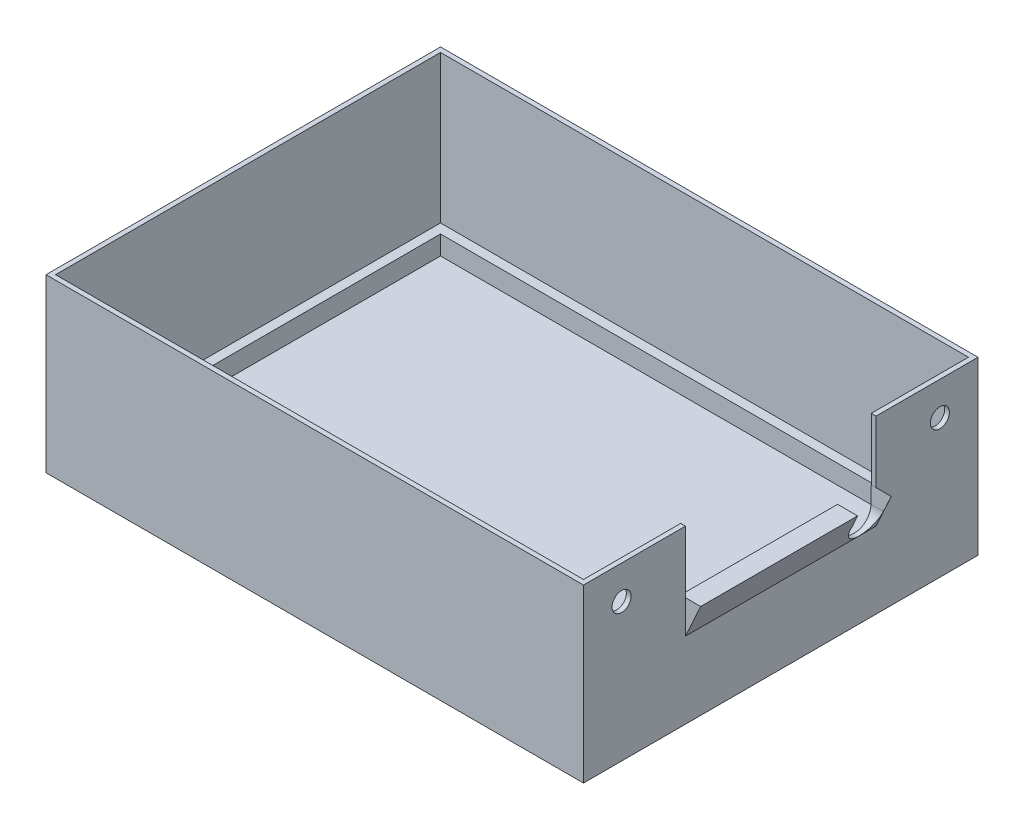
ISO-10303-21;
HEADER;
FILE_DESCRIPTION(('STEP AP214'),'2;1');
FILE_NAME('part.step','',(''),(''),'','','');
FILE_SCHEMA(('AUTOMOTIVE_DESIGN { 1 0 10303 214 1 1 1 1 }'));
ENDSEC;
DATA;
#1=APPLICATION_CONTEXT('core data for automotive mechanical design processes');
#2=APPLICATION_PROTOCOL_DEFINITION('international standard','automotive_design',2000,#1);
#3=PRODUCT_CONTEXT('',#1,'mechanical');
#4=PRODUCT('Part','Part','',(#3));
#5=PRODUCT_RELATED_PRODUCT_CATEGORY('part','',(#4));
#6=PRODUCT_DEFINITION_FORMATION('','',#4);
#7=PRODUCT_DEFINITION_CONTEXT('part definition',#1,'design');
#8=PRODUCT_DEFINITION('design','',#6,#7);
#9=PRODUCT_DEFINITION_SHAPE('','',#8);
#10=(LENGTH_UNIT() NAMED_UNIT(*) SI_UNIT(.MILLI.,.METRE.));
#11=(NAMED_UNIT(*) PLANE_ANGLE_UNIT() SI_UNIT($,.RADIAN.));
#12=(NAMED_UNIT(*) SI_UNIT($,.STERADIAN.) SOLID_ANGLE_UNIT());
#13=UNCERTAINTY_MEASURE_WITH_UNIT(LENGTH_MEASURE(1.E-05),#10,'distance_accuracy_value','');
#14=(GEOMETRIC_REPRESENTATION_CONTEXT(3) GLOBAL_UNCERTAINTY_ASSIGNED_CONTEXT((#13)) GLOBAL_UNIT_ASSIGNED_CONTEXT((#10,
#11,#12)) REPRESENTATION_CONTEXT('',''));
#15=CARTESIAN_POINT('',(0.,0.,0.));
#16=DIRECTION('',(0.,0.,1.));
#17=DIRECTION('',(1.,0.,0.));
#18=AXIS2_PLACEMENT_3D('',#15,#16,#17);
#19=CARTESIAN_POINT('',(22.0042253521127,36.,-44.0316901408451));
#20=DIRECTION('',(-1.,0.,0.));
#21=DIRECTION('',(0.,0.,1.));
#22=AXIS2_PLACEMENT_3D('',#19,#20,#21);
#23=PLANE('',#22);
#24=CARTESIAN_POINT('',(22.0042253521127,29.,-36.0316901408451));
#25=DIRECTION('',(-1.,0.,0.));
#26=DIRECTION('',(0.,0.,1.));
#27=AXIS2_PLACEMENT_3D('',#24,#25,#26);
#28=CIRCLE('',#27,2.);
#29=CARTESIAN_POINT('',(22.0042253521127,29.,-34.0316901408451));
#30=VERTEX_POINT('',#29);
#31=EDGE_CURVE('E336',#30,#30,#28,.F.);
#32=ORIENTED_EDGE('',*,*,#31,.T.);
#33=EDGE_LOOP('',(#32));
#34=FACE_BOUND('',#33,.T.);
#35=CARTESIAN_POINT('',(22.0042253521127,29.,30.7683098591549));
#36=DIRECTION('',(-1.,0.,0.));
#37=DIRECTION('',(0.,0.,1.));
#38=AXIS2_PLACEMENT_3D('',#35,#36,#37);
#39=CIRCLE('',#38,2.);
#40=CARTESIAN_POINT('',(22.0042253521127,29.,32.7683098591549));
#41=VERTEX_POINT('',#40);
#42=EDGE_CURVE('E337',#41,#41,#39,.F.);
#43=ORIENTED_EDGE('',*,*,#42,.T.);
#44=EDGE_LOOP('',(#43));
#45=FACE_BOUND('',#44,.T.);
#46=CARTESIAN_POINT('',(22.0042253521127,19.5,-19.0604966113483));
#47=DIRECTION('',(-1.,0.,0.));
#48=DIRECTION('',(0.,0.,1.));
#49=AXIS2_PLACEMENT_3D('',#46,#47,#48);
#50=CIRCLE('',#49,3.5);
#51=CARTESIAN_POINT('',(22.0042253521127,19.5,-22.5604966113483));
#52=VERTEX_POINT('',#51);
#53=CARTESIAN_POINT('',(22.0042253521127,19.5,-15.5604966113483));
#54=VERTEX_POINT('',#53);
#55=EDGE_CURVE('E569',#52,#54,#50,.T.);
#56=ORIENTED_EDGE('',*,*,#55,.F.);
#57=DIRECTION('',(0.,0.9997931858639,-0.0203368016195662));
#58=VECTOR('',#57,1.);
#59=CARTESIAN_POINT('',(22.0042253521127,-0.450648538720365,-22.1546803012851));
#60=LINE('',#59,#58);
#61=CARTESIAN_POINT('',(22.0042253521127,23.,-22.6316901408451));
#62=VERTEX_POINT('',#61);
#63=EDGE_CURVE('E343',#52,#62,#60,.T.);
#64=ORIENTED_EDGE('',*,*,#63,.T.);
#65=DIRECTION('',(0.,-1.,0.));
#66=VECTOR('',#65,1.);
#67=CARTESIAN_POINT('',(22.0042253521127,36.,-22.6316901408451));
#68=LINE('',#67,#66);
#69=CARTESIAN_POINT('',(22.0042253521127,36.,-22.6316901408451));
#70=VERTEX_POINT('',#69);
#71=EDGE_CURVE('E287',#70,#62,#68,.T.);
#72=ORIENTED_EDGE('',*,*,#71,.F.);
#73=DIRECTION('',(0.,0.,-1.));
#74=VECTOR('',#73,1.);
#75=CARTESIAN_POINT('',(22.0042253521127,36.,-44.0316901408451));
#76=LINE('',#75,#74);
#77=CARTESIAN_POINT('',(22.0042253521127,36.,-43.0316901408451));
#78=VERTEX_POINT('',#77);
#79=EDGE_CURVE('E383',#70,#78,#76,.T.);
#80=ORIENTED_EDGE('',*,*,#79,.T.);
#81=DIRECTION('',(0.,-1.,0.));
#82=VECTOR('',#81,1.);
#83=CARTESIAN_POINT('',(22.0042253521127,36.,-43.0316901408451));
#84=LINE('',#83,#82);
#85=CARTESIAN_POINT('',(22.0042253521127,5.,-43.0316901408451));
#86=VERTEX_POINT('',#85);
#87=EDGE_CURVE('E403',#78,#86,#84,.T.);
#88=ORIENTED_EDGE('',*,*,#87,.T.);
#89=DIRECTION('',(0.,0.,-1.));
#90=VECTOR('',#89,1.);
#91=CARTESIAN_POINT('',(22.0042253521127,5.,-43.0316901408451));
#92=LINE('',#91,#90);
#93=CARTESIAN_POINT('',(22.0042253521127,5.,37.7683098591549));
#94=VERTEX_POINT('',#93);
#95=EDGE_CURVE('E435',#94,#86,#92,.T.);
#96=ORIENTED_EDGE('',*,*,#95,.F.);
#97=DIRECTION('',(0.,-1.,0.));
#98=VECTOR('',#97,1.);
#99=CARTESIAN_POINT('',(22.0042253521127,36.,37.7683098591549));
#100=LINE('',#99,#98);
#101=CARTESIAN_POINT('',(22.0042253521127,36.,37.7683098591549));
#102=VERTEX_POINT('',#101);
#103=EDGE_CURVE('E408',#102,#94,#100,.T.);
#104=ORIENTED_EDGE('',*,*,#103,.F.);
#105=CARTESIAN_POINT('',(22.0042253521127,36.,17.3683098591549));
#106=VERTEX_POINT('',#105);
#107=EDGE_CURVE('E376',#102,#106,#76,.T.);
#108=ORIENTED_EDGE('',*,*,#107,.T.);
#109=DIRECTION('',(0.,-1.,0.));
#110=VECTOR('',#109,1.);
#111=CARTESIAN_POINT('',(22.0042253521127,36.,17.3683098591549));
#112=LINE('',#111,#110);
#113=CARTESIAN_POINT('',(22.0042253521127,23.,17.3683098591549));
#114=VERTEX_POINT('',#113);
#115=EDGE_CURVE('E325',#106,#114,#112,.T.);
#116=ORIENTED_EDGE('',*,*,#115,.T.);
#117=DIRECTION('',(0.,0.,-1.));
#118=VECTOR('',#117,1.);
#119=CARTESIAN_POINT('',(22.0042253521127,23.,17.368309859155));
#120=LINE('',#119,#118);
#121=CARTESIAN_POINT('',(22.0042253521127,23.,-15.5604966113483));
#122=VERTEX_POINT('',#121);
#123=EDGE_CURVE('E496',#114,#122,#120,.T.);
#124=ORIENTED_EDGE('',*,*,#123,.T.);
#125=DIRECTION('',(0.,-1.,0.));
#126=VECTOR('',#125,1.);
#127=CARTESIAN_POINT('',(22.0042253521127,0.,-15.5604966113483));
#128=LINE('',#127,#126);
#129=EDGE_CURVE('E247',#122,#54,#128,.T.);
#130=ORIENTED_EDGE('',*,*,#129,.T.);
#131=EDGE_LOOP('',(#56,#64,#72,#80,#88,#96,#104,#108,#116,#124,#130));
#132=FACE_BOUND('',#131,.T.);
#133=ADVANCED_FACE('F46',(#34,#45,#132),#23,.T.);
#134=CARTESIAN_POINT('',(-89.7967746478873,23.,17.368309859155));
#135=DIRECTION('',(0.,-1.,0.));
#136=DIRECTION('',(0.,0.,-1.));
#137=AXIS2_PLACEMENT_3D('',#134,#135,#136);
#138=PLANE('',#137);
#139=DIRECTION('',(-1.,0.,0.));
#140=VECTOR('',#139,1.);
#141=CARTESIAN_POINT('',(26.2052253521127,23.,-15.5604966113483));
#142=LINE('',#141,#140);
#143=CARTESIAN_POINT('',(26.2042253521127,23.,-15.5604966113483));
#144=VERTEX_POINT('',#143);
#145=EDGE_CURVE('E241',#144,#122,#142,.T.);
#146=ORIENTED_EDGE('',*,*,#145,.T.);
#147=ORIENTED_EDGE('',*,*,#123,.F.);
#148=DIRECTION('',(1.,0.,0.));
#149=VECTOR('',#148,1.);
#150=CARTESIAN_POINT('',(-89.7967746478873,23.,17.368309859155));
#151=LINE('',#150,#149);
#152=CARTESIAN_POINT('',(23.0042253521127,23.,17.3683098591549));
#153=VERTEX_POINT('',#152);
#154=EDGE_CURVE('E483',#114,#153,#151,.T.);
#155=ORIENTED_EDGE('',*,*,#154,.T.);
#156=DIRECTION('',(1.,0.,0.));
#157=VECTOR('',#156,1.);
#158=CARTESIAN_POINT('',(23.0042253521127,23.,17.3683098591549));
#159=LINE('',#158,#157);
#160=CARTESIAN_POINT('',(26.2042253521127,23.,17.3683098591549));
#161=VERTEX_POINT('',#160);
#162=EDGE_CURVE('E271',#153,#161,#159,.T.);
#163=ORIENTED_EDGE('',*,*,#162,.T.);
#164=DIRECTION('',(0.,0.,-1.));
#165=VECTOR('',#164,1.);
#166=CARTESIAN_POINT('',(26.2042253521127,23.,17.3683098591549));
#167=LINE('',#166,#165);
#168=EDGE_CURVE('E260',#161,#144,#167,.T.);
#169=ORIENTED_EDGE('',*,*,#168,.T.);
#170=EDGE_LOOP('',(#146,#147,#155,#163,#169));
#171=FACE_BOUND('',#170,.T.);
#172=ADVANCED_FACE('F268',(#171),#138,.F.);
#173=CARTESIAN_POINT('',(26.2042253521127,23.,17.3683098591549));
#174=DIRECTION('',(0.909474475585799,-0.415759760267796,0.));
#175=DIRECTION('',(0.415759760267796,0.9094744755858,0.));
#176=AXIS2_PLACEMENT_3D('',#173,#174,#175);
#177=PLANE('',#176);
#178=DIRECTION('',(-0.415759760267796,-0.909474475585799,0.));
#179=VECTOR('',#178,1.);
#180=CARTESIAN_POINT('',(26.2042253521127,23.,-22.6316901408451));
#181=LINE('',#180,#179);
#182=CARTESIAN_POINT('',(26.2042253521127,23.,-22.6316901408451));
#183=VERTEX_POINT('',#182);
#184=CARTESIAN_POINT('',(23.0042253521127,16.,-22.6316901408451));
#185=VERTEX_POINT('',#184);
#186=EDGE_CURVE('E517',#183,#185,#181,.T.);
#187=ORIENTED_EDGE('',*,*,#186,.F.);
#188=DIRECTION('',(0.415688634496102,0.90931888796022,-0.0184964631634217));
#189=VECTOR('',#188,1.);
#190=CARTESIAN_POINT('',(17.3365371821894,3.60193212829279,-22.2371138787865));
#191=LINE('',#190,#189);
#192=CARTESIAN_POINT('',(24.6042253521127,19.5,-22.5604966113483));
#193=VERTEX_POINT('',#192);
#194=EDGE_CURVE('E264',#193,#183,#191,.T.);
#195=ORIENTED_EDGE('',*,*,#194,.F.);
#196=CARTESIAN_POINT('',(24.6042253521127,19.5,-19.0604966113483));
#197=DIRECTION('',(0.909474475585799,-0.415759760267796,0.));
#198=DIRECTION('',(-0.415759760267796,-0.9094744755858,0.));
#199=AXIS2_PLACEMENT_3D('',#196,#197,#198);
#200=ELLIPSE('',#199,3.84837628097877,3.5);
#201=CARTESIAN_POINT('',(23.0042253521127,16.,-19.0604966113483));
#202=VERTEX_POINT('',#201);
#203=EDGE_CURVE('E512',#193,#202,#200,.F.);
#204=ORIENTED_EDGE('',*,*,#203,.T.);
#205=DIRECTION('',(0.,0.,-1.));
#206=VECTOR('',#205,1.);
#207=CARTESIAN_POINT('',(23.0042253521127,16.,17.3683098591549));
#208=LINE('',#207,#206);
#209=EDGE_CURVE('E67',#202,#185,#208,.T.);
#210=ORIENTED_EDGE('',*,*,#209,.T.);
#211=EDGE_LOOP('',(#187,#195,#204,#210));
#212=FACE_BOUND('',#211,.T.);
#213=ADVANCED_FACE('F561',(#212),#177,.T.);
#214=CARTESIAN_POINT('',(24.6042253521127,19.5,-15.5604966113483));
#215=VERTEX_POINT('',#214);
#216=EDGE_CURVE('E253',#202,#215,#200,.F.);
#217=ORIENTED_EDGE('',*,*,#216,.T.);
#218=DIRECTION('',(-0.415759760267796,-0.9094744755858,0.));
#219=VECTOR('',#218,1.);
#220=CARTESIAN_POINT('',(17.5075717396886,3.97607022282245,-15.5604966113483));
#221=LINE('',#220,#219);
#222=EDGE_CURVE('E244',#144,#215,#221,.T.);
#223=ORIENTED_EDGE('',*,*,#222,.F.);
#224=ORIENTED_EDGE('',*,*,#168,.F.);
#225=DIRECTION('',(-0.415759760267796,-0.909474475585799,0.));
#226=VECTOR('',#225,1.);
#227=CARTESIAN_POINT('',(26.2042253521127,23.,17.3683098591549));
#228=LINE('',#227,#226);
#229=CARTESIAN_POINT('',(23.0042253521127,16.,17.3683098591549));
#230=VERTEX_POINT('',#229);
#231=EDGE_CURVE('E281',#161,#230,#228,.T.);
#232=ORIENTED_EDGE('',*,*,#231,.T.);
#233=EDGE_CURVE('E277',#230,#202,#208,.T.);
#234=ORIENTED_EDGE('',*,*,#233,.T.);
#235=EDGE_LOOP('',(#217,#223,#224,#232,#234));
#236=FACE_BOUND('',#235,.T.);
#237=ADVANCED_FACE('F258',(#236),#177,.T.);
#238=CARTESIAN_POINT('',(23.0042253521127,36.,-44.0316901408451));
#239=DIRECTION('',(-1.,0.,0.));
#240=DIRECTION('',(0.,0.,1.));
#241=AXIS2_PLACEMENT_3D('',#238,#239,#240);
#242=PLANE('',#241);
#243=CARTESIAN_POINT('',(23.0042253521127,29.,-36.0316901408451));
#244=DIRECTION('',(1.,0.,0.));
#245=DIRECTION('',(0.,0.,-1.));
#246=AXIS2_PLACEMENT_3D('',#243,#244,#245);
#247=CIRCLE('',#246,2.);
#248=CARTESIAN_POINT('',(23.0042253521127,29.,-38.0316901408451));
#249=VERTEX_POINT('',#248);
#250=EDGE_CURVE('E265',#249,#249,#247,.T.);
#251=ORIENTED_EDGE('',*,*,#250,.F.);
#252=EDGE_LOOP('',(#251));
#253=FACE_BOUND('',#252,.T.);
#254=CARTESIAN_POINT('',(23.0042253521127,29.,30.7683098591549));
#255=DIRECTION('',(1.,0.,0.));
#256=DIRECTION('',(0.,0.,-1.));
#257=AXIS2_PLACEMENT_3D('',#254,#255,#256);
#258=CIRCLE('',#257,2.);
#259=CARTESIAN_POINT('',(23.0042253521127,29.,28.7683098591549));
#260=VERTEX_POINT('',#259);
#261=EDGE_CURVE('E331',#260,#260,#258,.T.);
#262=ORIENTED_EDGE('',*,*,#261,.F.);
#263=EDGE_LOOP('',(#262));
#264=FACE_BOUND('',#263,.T.);
#265=DIRECTION('',(0.,-1.,0.));
#266=VECTOR('',#265,1.);
#267=CARTESIAN_POINT('',(23.0042253521127,36.,-22.6316901408451));
#268=LINE('',#267,#266);
#269=CARTESIAN_POINT('',(23.0042253521127,36.,-22.6316901408451));
#270=VERTEX_POINT('',#269);
#271=CARTESIAN_POINT('',(23.0042253521127,23.,-22.6316901408451));
#272=VERTEX_POINT('',#271);
#273=EDGE_CURVE('E319',#270,#272,#268,.T.);
#274=ORIENTED_EDGE('',*,*,#273,.T.);
#275=DIRECTION('',(0.,-1.,0.));
#276=VECTOR('',#275,1.);
#277=CARTESIAN_POINT('',(23.0042253521127,23.,-22.6316901408451));
#278=LINE('',#277,#276);
#279=EDGE_CURVE('E551',#272,#185,#278,.T.);
#280=ORIENTED_EDGE('',*,*,#279,.T.);
#281=ORIENTED_EDGE('',*,*,#209,.F.);
#282=ORIENTED_EDGE('',*,*,#233,.F.);
#283=DIRECTION('',(0.,-1.,0.));
#284=VECTOR('',#283,1.);
#285=CARTESIAN_POINT('',(23.0042253521127,23.,17.3683098591549));
#286=LINE('',#285,#284);
#287=EDGE_CURVE('E273',#153,#230,#286,.T.);
#288=ORIENTED_EDGE('',*,*,#287,.F.);
#289=DIRECTION('',(0.,-1.,0.));
#290=VECTOR('',#289,1.);
#291=CARTESIAN_POINT('',(23.0042253521127,36.,17.3683098591549));
#292=LINE('',#291,#290);
#293=CARTESIAN_POINT('',(23.0042253521127,36.,17.3683098591549));
#294=VERTEX_POINT('',#293);
#295=EDGE_CURVE('E313',#294,#153,#292,.T.);
#296=ORIENTED_EDGE('',*,*,#295,.F.);
#297=DIRECTION('',(0.,0.,-1.));
#298=VECTOR('',#297,1.);
#299=CARTESIAN_POINT('',(23.0042253521127,36.,-44.0316901408451));
#300=LINE('',#299,#298);
#301=CARTESIAN_POINT('',(23.0042253521127,36.,38.7683098591549));
#302=VERTEX_POINT('',#301);
#303=EDGE_CURVE('E478',#302,#294,#300,.T.);
#304=ORIENTED_EDGE('',*,*,#303,.F.);
#305=DIRECTION('',(0.,-1.,0.));
#306=VECTOR('',#305,1.);
#307=CARTESIAN_POINT('',(23.0042253521127,36.,38.7683098591549));
#308=LINE('',#307,#306);
#309=CARTESIAN_POINT('',(23.0042253521127,0.,38.7683098591549));
#310=VERTEX_POINT('',#309);
#311=EDGE_CURVE('E57',#302,#310,#308,.T.);
#312=ORIENTED_EDGE('',*,*,#311,.T.);
#313=DIRECTION('',(0.,0.,-1.));
#314=VECTOR('',#313,1.);
#315=CARTESIAN_POINT('',(23.0042253521127,0.,-44.0316901408451));
#316=LINE('',#315,#314);
#317=CARTESIAN_POINT('',(23.0042253521127,0.,-44.0316901408451));
#318=VERTEX_POINT('',#317);
#319=EDGE_CURVE('E368',#310,#318,#316,.T.);
#320=ORIENTED_EDGE('',*,*,#319,.T.);
#321=DIRECTION('',(0.,-1.,0.));
#322=VECTOR('',#321,1.);
#323=CARTESIAN_POINT('',(23.0042253521127,36.,-44.0316901408451));
#324=LINE('',#323,#322);
#325=CARTESIAN_POINT('',(23.0042253521127,36.,-44.0316901408451));
#326=VERTEX_POINT('',#325);
#327=EDGE_CURVE('E546',#326,#318,#324,.T.);
#328=ORIENTED_EDGE('',*,*,#327,.F.);
#329=EDGE_CURVE('E520',#270,#326,#300,.T.);
#330=ORIENTED_EDGE('',*,*,#329,.F.);
#331=EDGE_LOOP('',(#274,#280,#281,#282,#288,#296,#304,#312,#320,#328,#330));
#332=FACE_BOUND('',#331,.T.);
#333=ADVANCED_FACE('F547',(#253,#264,#332),#242,.F.);
#334=CARTESIAN_POINT('',(0.,36.,0.));
#335=DIRECTION('',(0.,1.,0.));
#336=DIRECTION('',(0.,0.,1.));
#337=AXIS2_PLACEMENT_3D('',#334,#335,#336);
#338=PLANE('',#337);
#339=ORIENTED_EDGE('',*,*,#79,.F.);
#340=DIRECTION('',(1.,0.,0.));
#341=VECTOR('',#340,1.);
#342=CARTESIAN_POINT('',(-89.7967746478873,36.,-22.631690140845));
#343=LINE('',#342,#341);
#344=EDGE_CURVE('E318',#70,#270,#343,.T.);
#345=ORIENTED_EDGE('',*,*,#344,.T.);
#346=ORIENTED_EDGE('',*,*,#329,.T.);
#347=DIRECTION('',(-1.,0.,0.));
#348=VECTOR('',#347,1.);
#349=CARTESIAN_POINT('',(-89.7957746478873,36.,-44.0316901408451));
#350=LINE('',#349,#348);
#351=CARTESIAN_POINT('',(-89.7957746478873,36.,-44.0316901408451));
#352=VERTEX_POINT('',#351);
#353=EDGE_CURVE('E362',#326,#352,#350,.T.);
#354=ORIENTED_EDGE('',*,*,#353,.T.);
#355=DIRECTION('',(0.,0.,1.));
#356=VECTOR('',#355,1.);
#357=CARTESIAN_POINT('',(-89.7957746478873,36.,-44.0316901408451));
#358=LINE('',#357,#356);
#359=CARTESIAN_POINT('',(-89.7957746478873,36.,38.7683098591549));
#360=VERTEX_POINT('',#359);
#361=EDGE_CURVE('E525',#352,#360,#358,.T.);
#362=ORIENTED_EDGE('',*,*,#361,.T.);
#363=DIRECTION('',(1.,0.,0.));
#364=VECTOR('',#363,1.);
#365=CARTESIAN_POINT('',(-89.7957746478873,36.,38.7683098591549));
#366=LINE('',#365,#364);
#367=EDGE_CURVE('E522',#360,#302,#366,.T.);
#368=ORIENTED_EDGE('',*,*,#367,.T.);
#369=ORIENTED_EDGE('',*,*,#303,.T.);
#370=DIRECTION('',(1.,0.,0.));
#371=VECTOR('',#370,1.);
#372=CARTESIAN_POINT('',(-89.7967746478873,36.,17.368309859155));
#373=LINE('',#372,#371);
#374=EDGE_CURVE('E324',#106,#294,#373,.T.);
#375=ORIENTED_EDGE('',*,*,#374,.F.);
#376=ORIENTED_EDGE('',*,*,#107,.F.);
#377=DIRECTION('',(1.,0.,0.));
#378=VECTOR('',#377,1.);
#379=CARTESIAN_POINT('',(-89.7957746478873,36.,37.7683098591549));
#380=LINE('',#379,#378);
#381=CARTESIAN_POINT('',(-88.7957746478873,36.,37.7683098591549));
#382=VERTEX_POINT('',#381);
#383=EDGE_CURVE('E384',#382,#102,#380,.T.);
#384=ORIENTED_EDGE('',*,*,#383,.F.);
#385=DIRECTION('',(0.,0.,1.));
#386=VECTOR('',#385,1.);
#387=CARTESIAN_POINT('',(-88.7957746478873,36.,-44.0316901408451));
#388=LINE('',#387,#386);
#389=CARTESIAN_POINT('',(-88.7957746478873,36.,-43.0316901408451));
#390=VERTEX_POINT('',#389);
#391=EDGE_CURVE('E398',#390,#382,#388,.T.);
#392=ORIENTED_EDGE('',*,*,#391,.F.);
#393=DIRECTION('',(-1.,0.,0.));
#394=VECTOR('',#393,1.);
#395=CARTESIAN_POINT('',(-89.7957746478873,36.,-43.0316901408451));
#396=LINE('',#395,#394);
#397=EDGE_CURVE('E382',#78,#390,#396,.T.);
#398=ORIENTED_EDGE('',*,*,#397,.F.);
#399=EDGE_LOOP('',(#339,#345,#346,#354,#362,#368,#369,#375,#376,#384,#392,#398));
#400=FACE_BOUND('',#399,.T.);
#401=ADVANCED_FACE('F475',(#400),#338,.T.);
#402=CARTESIAN_POINT('',(-89.7957746478873,36.,-44.0316901408451));
#403=DIRECTION('',(1.,0.,0.));
#404=DIRECTION('',(0.,0.,-1.));
#405=AXIS2_PLACEMENT_3D('',#402,#403,#404);
#406=PLANE('',#405);
#407=DIRECTION('',(0.,0.,1.));
#408=VECTOR('',#407,1.);
#409=CARTESIAN_POINT('',(-89.7957746478873,0.,-44.0316901408451));
#410=LINE('',#409,#408);
#411=CARTESIAN_POINT('',(-89.7957746478873,0.,-44.0316901408451));
#412=VERTEX_POINT('',#411);
#413=CARTESIAN_POINT('',(-89.7957746478873,0.,38.7683098591549));
#414=VERTEX_POINT('',#413);
#415=EDGE_CURVE('E354',#412,#414,#410,.T.);
#416=ORIENTED_EDGE('',*,*,#415,.T.);
#417=DIRECTION('',(0.,-1.,0.));
#418=VECTOR('',#417,1.);
#419=CARTESIAN_POINT('',(-89.7957746478873,36.,38.7683098591549));
#420=LINE('',#419,#418);
#421=EDGE_CURVE('E12',#360,#414,#420,.T.);
#422=ORIENTED_EDGE('',*,*,#421,.F.);
#423=ORIENTED_EDGE('',*,*,#361,.F.);
#424=DIRECTION('',(0.,-1.,0.));
#425=VECTOR('',#424,1.);
#426=CARTESIAN_POINT('',(-89.7957746478873,36.,-44.0316901408451));
#427=LINE('',#426,#425);
#428=EDGE_CURVE('E524',#352,#412,#427,.T.);
#429=ORIENTED_EDGE('',*,*,#428,.T.);
#430=EDGE_LOOP('',(#416,#422,#423,#429));
#431=FACE_BOUND('',#430,.T.);
#432=ADVANCED_FACE('F49',(#431),#406,.F.);
#433=CARTESIAN_POINT('',(-89.7957746478873,36.,38.7683098591549));
#434=DIRECTION('',(0.,0.,-1.));
#435=DIRECTION('',(-1.,0.,0.));
#436=AXIS2_PLACEMENT_3D('',#433,#434,#435);
#437=PLANE('',#436);
#438=DIRECTION('',(1.,0.,0.));
#439=VECTOR('',#438,1.);
#440=CARTESIAN_POINT('',(-89.7957746478873,0.,38.7683098591549));
#441=LINE('',#440,#439);
#442=EDGE_CURVE('E360',#414,#310,#441,.T.);
#443=ORIENTED_EDGE('',*,*,#442,.T.);
#444=ORIENTED_EDGE('',*,*,#311,.F.);
#445=ORIENTED_EDGE('',*,*,#367,.F.);
#446=ORIENTED_EDGE('',*,*,#421,.T.);
#447=EDGE_LOOP('',(#443,#444,#445,#446));
#448=FACE_BOUND('',#447,.T.);
#449=ADVANCED_FACE('F542',(#448),#437,.F.);
#450=CARTESIAN_POINT('',(-89.7957746478873,36.,-44.0316901408451));
#451=DIRECTION('',(0.,0.,1.));
#452=DIRECTION('',(1.,0.,0.));
#453=AXIS2_PLACEMENT_3D('',#450,#451,#452);
#454=PLANE('',#453);
#455=DIRECTION('',(-1.,0.,0.));
#456=VECTOR('',#455,1.);
#457=CARTESIAN_POINT('',(-89.7957746478873,0.,-44.0316901408451));
#458=LINE('',#457,#456);
#459=EDGE_CURVE('E528',#318,#412,#458,.T.);
#460=ORIENTED_EDGE('',*,*,#459,.T.);
#461=ORIENTED_EDGE('',*,*,#428,.F.);
#462=ORIENTED_EDGE('',*,*,#353,.F.);
#463=ORIENTED_EDGE('',*,*,#327,.T.);
#464=EDGE_LOOP('',(#460,#461,#462,#463));
#465=FACE_BOUND('',#464,.T.);
#466=ADVANCED_FACE('F707',(#465),#454,.F.);
#467=CARTESIAN_POINT('',(0.,0.,0.));
#468=DIRECTION('',(0.,1.,0.));
#469=DIRECTION('',(0.,0.,1.));
#470=AXIS2_PLACEMENT_3D('',#467,#468,#469);
#471=PLANE('',#470);
#472=ORIENTED_EDGE('',*,*,#415,.F.);
#473=ORIENTED_EDGE('',*,*,#459,.F.);
#474=ORIENTED_EDGE('',*,*,#319,.F.);
#475=ORIENTED_EDGE('',*,*,#442,.F.);
#476=EDGE_LOOP('',(#472,#473,#474,#475));
#477=FACE_BOUND('',#476,.T.);
#478=ADVANCED_FACE('F702',(#477),#471,.F.);
#479=CARTESIAN_POINT('',(-88.7957746478873,36.,-44.0316901408451));
#480=DIRECTION('',(1.,0.,0.));
#481=DIRECTION('',(0.,0.,-1.));
#482=AXIS2_PLACEMENT_3D('',#479,#480,#481);
#483=PLANE('',#482);
#484=DIRECTION('',(0.,0.,1.));
#485=VECTOR('',#484,1.);
#486=CARTESIAN_POINT('',(-88.7957746478873,5.,-43.0316901408451));
#487=LINE('',#486,#485);
#488=CARTESIAN_POINT('',(-88.7957746478873,5.,-43.0316901408451));
#489=VERTEX_POINT('',#488);
#490=CARTESIAN_POINT('',(-88.7957746478873,5.,37.7683098591549));
#491=VERTEX_POINT('',#490);
#492=EDGE_CURVE('E436',#489,#491,#487,.T.);
#493=ORIENTED_EDGE('',*,*,#492,.F.);
#494=DIRECTION('',(0.,-1.,0.));
#495=VECTOR('',#494,1.);
#496=CARTESIAN_POINT('',(-88.7957746478873,36.,-43.0316901408451));
#497=LINE('',#496,#495);
#498=EDGE_CURVE('E409',#390,#489,#497,.T.);
#499=ORIENTED_EDGE('',*,*,#498,.F.);
#500=ORIENTED_EDGE('',*,*,#391,.T.);
#501=DIRECTION('',(0.,-1.,0.));
#502=VECTOR('',#501,1.);
#503=CARTESIAN_POINT('',(-88.7957746478873,36.,37.7683098591549));
#504=LINE('',#503,#502);
#505=EDGE_CURVE('E361',#382,#491,#504,.T.);
#506=ORIENTED_EDGE('',*,*,#505,.T.);
#507=EDGE_LOOP('',(#493,#499,#500,#506));
#508=FACE_BOUND('',#507,.T.);
#509=ADVANCED_FACE('F706',(#508),#483,.T.);
#510=CARTESIAN_POINT('',(-89.7957746478873,36.,37.7683098591549));
#511=DIRECTION('',(0.,0.,-1.));
#512=DIRECTION('',(-1.,0.,0.));
#513=AXIS2_PLACEMENT_3D('',#510,#511,#512);
#514=PLANE('',#513);
#515=DIRECTION('',(1.,0.,0.));
#516=VECTOR('',#515,1.);
#517=CARTESIAN_POINT('',(-88.7957746478873,5.,37.7683098591549));
#518=LINE('',#517,#516);
#519=EDGE_CURVE('E78',#491,#94,#518,.T.);
#520=ORIENTED_EDGE('',*,*,#519,.F.);
#521=ORIENTED_EDGE('',*,*,#505,.F.);
#522=ORIENTED_EDGE('',*,*,#383,.T.);
#523=ORIENTED_EDGE('',*,*,#103,.T.);
#524=EDGE_LOOP('',(#520,#521,#522,#523));
#525=FACE_BOUND('',#524,.T.);
#526=ADVANCED_FACE('F470',(#525),#514,.T.);
#527=CARTESIAN_POINT('',(-89.7957746478873,36.,-43.0316901408451));
#528=DIRECTION('',(0.,0.,1.));
#529=DIRECTION('',(1.,0.,0.));
#530=AXIS2_PLACEMENT_3D('',#527,#528,#529);
#531=PLANE('',#530);
#532=DIRECTION('',(-1.,0.,0.));
#533=VECTOR('',#532,1.);
#534=CARTESIAN_POINT('',(-88.7957746478873,5.,-43.0316901408451));
#535=LINE('',#534,#533);
#536=EDGE_CURVE('E402',#86,#489,#535,.T.);
#537=ORIENTED_EDGE('',*,*,#536,.F.);
#538=ORIENTED_EDGE('',*,*,#87,.F.);
#539=ORIENTED_EDGE('',*,*,#397,.T.);
#540=ORIENTED_EDGE('',*,*,#498,.T.);
#541=EDGE_LOOP('',(#537,#538,#539,#540));
#542=FACE_BOUND('',#541,.T.);
#543=ADVANCED_FACE('F453',(#542),#531,.T.);
#544=CARTESIAN_POINT('',(0.,5.,0.));
#545=DIRECTION('',(0.,1.,0.));
#546=DIRECTION('',(0.,0.,1.));
#547=AXIS2_PLACEMENT_3D('',#544,#545,#546);
#548=PLANE('',#547);
#549=ORIENTED_EDGE('',*,*,#492,.T.);
#550=ORIENTED_EDGE('',*,*,#519,.T.);
#551=ORIENTED_EDGE('',*,*,#95,.T.);
#552=ORIENTED_EDGE('',*,*,#536,.T.);
#553=EDGE_LOOP('',(#549,#550,#551,#552));
#554=FACE_BOUND('',#553,.T.);
#555=DIRECTION('',(1.,0.,0.));
#556=VECTOR('',#555,1.);
#557=CARTESIAN_POINT('',(-86.7957746478873,5.,35.7683098591549));
#558=LINE('',#557,#556);
#559=CARTESIAN_POINT('',(-86.7957746478873,5.,35.7683098591549));
#560=VERTEX_POINT('',#559);
#561=CARTESIAN_POINT('',(20.0042253521127,5.,35.7683098591549));
#562=VERTEX_POINT('',#561);
#563=EDGE_CURVE('E586',#560,#562,#558,.T.);
#564=ORIENTED_EDGE('',*,*,#563,.F.);
#565=DIRECTION('',(0.,0.,1.));
#566=VECTOR('',#565,1.);
#567=CARTESIAN_POINT('',(-86.7957746478873,5.,-41.0316901408451));
#568=LINE('',#567,#566);
#569=CARTESIAN_POINT('',(-86.7957746478873,5.,-41.0316901408451));
#570=VERTEX_POINT('',#569);
#571=EDGE_CURVE('E497',#570,#560,#568,.T.);
#572=ORIENTED_EDGE('',*,*,#571,.F.);
#573=DIRECTION('',(-1.,0.,0.));
#574=VECTOR('',#573,1.);
#575=CARTESIAN_POINT('',(-86.7957746478873,5.,-41.0316901408451));
#576=LINE('',#575,#574);
#577=CARTESIAN_POINT('',(20.0042253521127,5.,-41.0316901408451));
#578=VERTEX_POINT('',#577);
#579=EDGE_CURVE('E585',#578,#570,#576,.T.);
#580=ORIENTED_EDGE('',*,*,#579,.F.);
#581=DIRECTION('',(0.,0.,-1.));
#582=VECTOR('',#581,1.);
#583=CARTESIAN_POINT('',(20.0042253521127,5.,-41.0316901408451));
#584=LINE('',#583,#582);
#585=EDGE_CURVE('E582',#562,#578,#584,.T.);
#586=ORIENTED_EDGE('',*,*,#585,.F.);
#587=EDGE_LOOP('',(#564,#572,#580,#586));
#588=FACE_BOUND('',#587,.T.);
#589=ADVANCED_FACE('F448',(#554,#588),#548,.T.);
#590=CARTESIAN_POINT('',(-86.7957746478873,5.,-41.0316901408451));
#591=DIRECTION('',(1.,0.,0.));
#592=DIRECTION('',(0.,0.,-1.));
#593=AXIS2_PLACEMENT_3D('',#590,#591,#592);
#594=PLANE('',#593);
#595=DIRECTION('',(0.,0.,1.));
#596=VECTOR('',#595,1.);
#597=CARTESIAN_POINT('',(-86.7957746478873,1.,-41.0316901408451));
#598=LINE('',#597,#596);
#599=CARTESIAN_POINT('',(-86.7957746478873,1.,-41.0316901408451));
#600=VERTEX_POINT('',#599);
#601=CARTESIAN_POINT('',(-86.7957746478873,1.,35.7683098591549));
#602=VERTEX_POINT('',#601);
#603=EDGE_CURVE('E495',#600,#602,#598,.T.);
#604=ORIENTED_EDGE('',*,*,#603,.F.);
#605=DIRECTION('',(0.,-1.,0.));
#606=VECTOR('',#605,1.);
#607=CARTESIAN_POINT('',(-86.7957746478873,5.,-41.0316901408451));
#608=LINE('',#607,#606);
#609=EDGE_CURVE('E589',#570,#600,#608,.T.);
#610=ORIENTED_EDGE('',*,*,#609,.F.);
#611=ORIENTED_EDGE('',*,*,#571,.T.);
#612=DIRECTION('',(0.,-1.,0.));
#613=VECTOR('',#612,1.);
#614=CARTESIAN_POINT('',(-86.7957746478873,5.,35.7683098591549));
#615=LINE('',#614,#613);
#616=EDGE_CURVE('E594',#560,#602,#615,.T.);
#617=ORIENTED_EDGE('',*,*,#616,.T.);
#618=EDGE_LOOP('',(#604,#610,#611,#617));
#619=FACE_BOUND('',#618,.T.);
#620=ADVANCED_FACE('F664',(#619),#594,.T.);
#621=CARTESIAN_POINT('',(-86.7957746478873,5.,35.7683098591549));
#622=DIRECTION('',(0.,0.,-1.));
#623=DIRECTION('',(-1.,0.,0.));
#624=AXIS2_PLACEMENT_3D('',#621,#622,#623);
#625=PLANE('',#624);
#626=DIRECTION('',(1.,0.,0.));
#627=VECTOR('',#626,1.);
#628=CARTESIAN_POINT('',(-86.7957746478873,1.,35.7683098591549));
#629=LINE('',#628,#627);
#630=CARTESIAN_POINT('',(20.0042253521127,1.,35.7683098591549));
#631=VERTEX_POINT('',#630);
#632=EDGE_CURVE('E635',#602,#631,#629,.T.);
#633=ORIENTED_EDGE('',*,*,#632,.F.);
#634=ORIENTED_EDGE('',*,*,#616,.F.);
#635=ORIENTED_EDGE('',*,*,#563,.T.);
#636=DIRECTION('',(0.,-1.,0.));
#637=VECTOR('',#636,1.);
#638=CARTESIAN_POINT('',(20.0042253521127,5.,35.7683098591549));
#639=LINE('',#638,#637);
#640=EDGE_CURVE('E597',#562,#631,#639,.T.);
#641=ORIENTED_EDGE('',*,*,#640,.T.);
#642=EDGE_LOOP('',(#633,#634,#635,#641));
#643=FACE_BOUND('',#642,.T.);
#644=ADVANCED_FACE('F652',(#643),#625,.T.);
#645=CARTESIAN_POINT('',(20.0042253521127,5.,-41.0316901408451));
#646=DIRECTION('',(-1.,0.,0.));
#647=DIRECTION('',(0.,0.,1.));
#648=AXIS2_PLACEMENT_3D('',#645,#646,#647);
#649=PLANE('',#648);
#650=DIRECTION('',(0.,0.,-1.));
#651=VECTOR('',#650,1.);
#652=CARTESIAN_POINT('',(20.0042253521127,1.,-41.0316901408451));
#653=LINE('',#652,#651);
#654=CARTESIAN_POINT('',(20.0042253521127,1.,-41.0316901408451));
#655=VERTEX_POINT('',#654);
#656=EDGE_CURVE('E631',#631,#655,#653,.T.);
#657=ORIENTED_EDGE('',*,*,#656,.F.);
#658=ORIENTED_EDGE('',*,*,#640,.F.);
#659=ORIENTED_EDGE('',*,*,#585,.T.);
#660=DIRECTION('',(0.,-1.,0.));
#661=VECTOR('',#660,1.);
#662=CARTESIAN_POINT('',(20.0042253521127,5.,-41.0316901408451));
#663=LINE('',#662,#661);
#664=EDGE_CURVE('E604',#578,#655,#663,.T.);
#665=ORIENTED_EDGE('',*,*,#664,.T.);
#666=EDGE_LOOP('',(#657,#658,#659,#665));
#667=FACE_BOUND('',#666,.T.);
#668=ADVANCED_FACE('F658',(#667),#649,.T.);
#669=CARTESIAN_POINT('',(-86.7957746478873,5.,-41.0316901408451));
#670=DIRECTION('',(0.,0.,1.));
#671=DIRECTION('',(1.,0.,0.));
#672=AXIS2_PLACEMENT_3D('',#669,#670,#671);
#673=PLANE('',#672);
#674=DIRECTION('',(-1.,0.,0.));
#675=VECTOR('',#674,1.);
#676=CARTESIAN_POINT('',(-86.7957746478873,1.,-41.0316901408451));
#677=LINE('',#676,#675);
#678=EDGE_CURVE('E592',#655,#600,#677,.T.);
#679=ORIENTED_EDGE('',*,*,#678,.F.);
#680=ORIENTED_EDGE('',*,*,#664,.F.);
#681=ORIENTED_EDGE('',*,*,#579,.T.);
#682=ORIENTED_EDGE('',*,*,#609,.T.);
#683=EDGE_LOOP('',(#679,#680,#681,#682));
#684=FACE_BOUND('',#683,.T.);
#685=ADVANCED_FACE('F661',(#684),#673,.T.);
#686=CARTESIAN_POINT('',(0.,1.,0.));
#687=DIRECTION('',(0.,1.,0.));
#688=DIRECTION('',(0.,0.,1.));
#689=AXIS2_PLACEMENT_3D('',#686,#687,#688);
#690=PLANE('',#689);
#691=ORIENTED_EDGE('',*,*,#603,.T.);
#692=ORIENTED_EDGE('',*,*,#632,.T.);
#693=ORIENTED_EDGE('',*,*,#656,.T.);
#694=ORIENTED_EDGE('',*,*,#678,.T.);
#695=EDGE_LOOP('',(#691,#692,#693,#694));
#696=FACE_BOUND('',#695,.T.);
#697=ADVANCED_FACE('F648',(#696),#690,.T.);
#698=CARTESIAN_POINT('',(-89.7967746478873,36.,-22.631690140845));
#699=DIRECTION('',(0.,0.,1.));
#700=DIRECTION('',(1.,0.,0.));
#701=AXIS2_PLACEMENT_3D('',#698,#699,#700);
#702=PLANE('',#701);
#703=ORIENTED_EDGE('',*,*,#71,.T.);
#704=DIRECTION('',(1.,0.,0.));
#705=VECTOR('',#704,1.);
#706=CARTESIAN_POINT('',(-89.7967746478873,23.,-22.631690140845));
#707=LINE('',#706,#705);
#708=EDGE_CURVE('E490',#62,#272,#707,.T.);
#709=ORIENTED_EDGE('',*,*,#708,.T.);
#710=ORIENTED_EDGE('',*,*,#273,.F.);
#711=ORIENTED_EDGE('',*,*,#344,.F.);
#712=EDGE_LOOP('',(#703,#709,#710,#711));
#713=FACE_BOUND('',#712,.T.);
#714=ADVANCED_FACE('F697',(#713),#702,.T.);
#715=CARTESIAN_POINT('',(-89.7967746478873,36.,17.368309859155));
#716=DIRECTION('',(0.,0.,1.));
#717=DIRECTION('',(1.,0.,0.));
#718=AXIS2_PLACEMENT_3D('',#715,#716,#717);
#719=PLANE('',#718);
#720=ORIENTED_EDGE('',*,*,#374,.T.);
#721=ORIENTED_EDGE('',*,*,#295,.T.);
#722=ORIENTED_EDGE('',*,*,#154,.F.);
#723=ORIENTED_EDGE('',*,*,#115,.F.);
#724=EDGE_LOOP('',(#720,#721,#722,#723));
#725=FACE_BOUND('',#724,.T.);
#726=ADVANCED_FACE('F548',(#725),#719,.F.);
#727=CARTESIAN_POINT('',(0.,0.,17.3683098591549));
#728=DIRECTION('',(0.,0.,-1.));
#729=DIRECTION('',(-1.,0.,0.));
#730=AXIS2_PLACEMENT_3D('',#727,#728,#729);
#731=PLANE('',#730);
#732=ORIENTED_EDGE('',*,*,#162,.F.);
#733=ORIENTED_EDGE('',*,*,#287,.T.);
#734=ORIENTED_EDGE('',*,*,#231,.F.);
#735=EDGE_LOOP('',(#732,#733,#734));
#736=FACE_BOUND('',#735,.T.);
#737=ADVANCED_FACE('F550',(#736),#731,.F.);
#738=CARTESIAN_POINT('',(0.,0.,-22.6316901408451));
#739=DIRECTION('',(0.,0.,-1.));
#740=DIRECTION('',(-1.,0.,0.));
#741=AXIS2_PLACEMENT_3D('',#738,#739,#740);
#742=PLANE('',#741);
#743=DIRECTION('',(1.,0.,0.));
#744=VECTOR('',#743,1.);
#745=CARTESIAN_POINT('',(23.0042253521127,23.,-22.6316901408451));
#746=LINE('',#745,#744);
#747=EDGE_CURVE('E303',#272,#183,#746,.T.);
#748=ORIENTED_EDGE('',*,*,#747,.T.);
#749=ORIENTED_EDGE('',*,*,#186,.T.);
#750=ORIENTED_EDGE('',*,*,#279,.F.);
#751=EDGE_LOOP('',(#748,#749,#750));
#752=FACE_BOUND('',#751,.T.);
#753=ADVANCED_FACE('F560',(#752),#742,.T.);
#754=CARTESIAN_POINT('',(26.2052253521127,-0.450648538720365,-22.1546803012851));
#755=DIRECTION('',(0.,0.0203368016195662,0.9997931858639));
#756=DIRECTION('',(0.,-0.9997931858639,0.0203368016195662));
#757=AXIS2_PLACEMENT_3D('',#754,#755,#756);
#758=PLANE('',#757);
#759=ORIENTED_EDGE('',*,*,#194,.T.);
#760=ORIENTED_EDGE('',*,*,#747,.F.);
#761=ORIENTED_EDGE('',*,*,#708,.F.);
#762=ORIENTED_EDGE('',*,*,#63,.F.);
#763=DIRECTION('',(-1.,0.,0.));
#764=VECTOR('',#763,1.);
#765=CARTESIAN_POINT('',(26.2052253521127,19.5,-22.5604966113483));
#766=LINE('',#765,#764);
#767=EDGE_CURVE('E507',#193,#52,#766,.T.);
#768=ORIENTED_EDGE('',*,*,#767,.F.);
#769=EDGE_LOOP('',(#759,#760,#761,#762,#768));
#770=FACE_BOUND('',#769,.T.);
#771=ADVANCED_FACE('F564',(#770),#758,.T.);
#772=CARTESIAN_POINT('',(26.2052253521127,0.,-15.5604966113483));
#773=DIRECTION('',(0.,0.,-1.));
#774=DIRECTION('',(-1.,0.,0.));
#775=AXIS2_PLACEMENT_3D('',#772,#773,#774);
#776=PLANE('',#775);
#777=ORIENTED_EDGE('',*,*,#222,.T.);
#778=DIRECTION('',(-1.,0.,0.));
#779=VECTOR('',#778,1.);
#780=CARTESIAN_POINT('',(26.2052253521127,19.5,-15.5604966113483));
#781=LINE('',#780,#779);
#782=EDGE_CURVE('E254',#215,#54,#781,.T.);
#783=ORIENTED_EDGE('',*,*,#782,.T.);
#784=ORIENTED_EDGE('',*,*,#129,.F.);
#785=ORIENTED_EDGE('',*,*,#145,.F.);
#786=EDGE_LOOP('',(#777,#783,#784,#785));
#787=FACE_BOUND('',#786,.T.);
#788=ADVANCED_FACE('F243',(#787),#776,.T.);
#789=CARTESIAN_POINT('',(26.2052253521127,19.5,-19.0604966113483));
#790=DIRECTION('',(-1.,0.,0.));
#791=DIRECTION('',(0.,0.,1.));
#792=AXIS2_PLACEMENT_3D('',#789,#790,#791);
#793=CYLINDRICAL_SURFACE('',#792,3.5);
#794=ORIENTED_EDGE('',*,*,#203,.F.);
#795=ORIENTED_EDGE('',*,*,#767,.T.);
#796=ORIENTED_EDGE('',*,*,#55,.T.);
#797=ORIENTED_EDGE('',*,*,#782,.F.);
#798=ORIENTED_EDGE('',*,*,#216,.F.);
#799=EDGE_LOOP('',(#794,#795,#796,#797,#798));
#800=FACE_BOUND('',#799,.T.);
#801=ADVANCED_FACE('F568',(#800),#793,.F.);
#802=CARTESIAN_POINT('',(-89.7967746478873,29.,30.768309859155));
#803=DIRECTION('',(1.,0.,0.));
#804=DIRECTION('',(0.,0.,-1.));
#805=AXIS2_PLACEMENT_3D('',#802,#803,#804);
#806=CYLINDRICAL_SURFACE('',#805,2.);
#807=ORIENTED_EDGE('',*,*,#42,.F.);
#808=EDGE_LOOP('',(#807));
#809=FACE_BOUND('',#808,.T.);
#810=ORIENTED_EDGE('',*,*,#261,.T.);
#811=EDGE_LOOP('',(#810));
#812=FACE_BOUND('',#811,.T.);
#813=ADVANCED_FACE('F754',(#809,#812),#806,.F.);
#814=CARTESIAN_POINT('',(-89.7967746478873,29.,-36.031690140845));
#815=DIRECTION('',(1.,0.,0.));
#816=DIRECTION('',(0.,0.,-1.));
#817=AXIS2_PLACEMENT_3D('',#814,#815,#816);
#818=CYLINDRICAL_SURFACE('',#817,2.);
#819=ORIENTED_EDGE('',*,*,#31,.F.);
#820=EDGE_LOOP('',(#819));
#821=FACE_BOUND('',#820,.T.);
#822=ORIENTED_EDGE('',*,*,#250,.T.);
#823=EDGE_LOOP('',(#822));
#824=FACE_BOUND('',#823,.T.);
#825=ADVANCED_FACE('F750',(#821,#824),#818,.F.);
#826=CLOSED_SHELL('',(#133,#172,#213,#237,#333,#401,#432,#449,#466,#478,#509,#526,#543,#589,
#620,#644,#668,#685,#697,#714,#726,#737,#753,#771,#788,#801,#813,#825));
#827=MANIFOLD_SOLID_BREP('B2',#826);
#828=ADVANCED_BREP_SHAPE_REPRESENTATION('',(#18,#827),#14);
#829=SHAPE_DEFINITION_REPRESENTATION(#9,#828);
ENDSEC;
END-ISO-10303-21;
